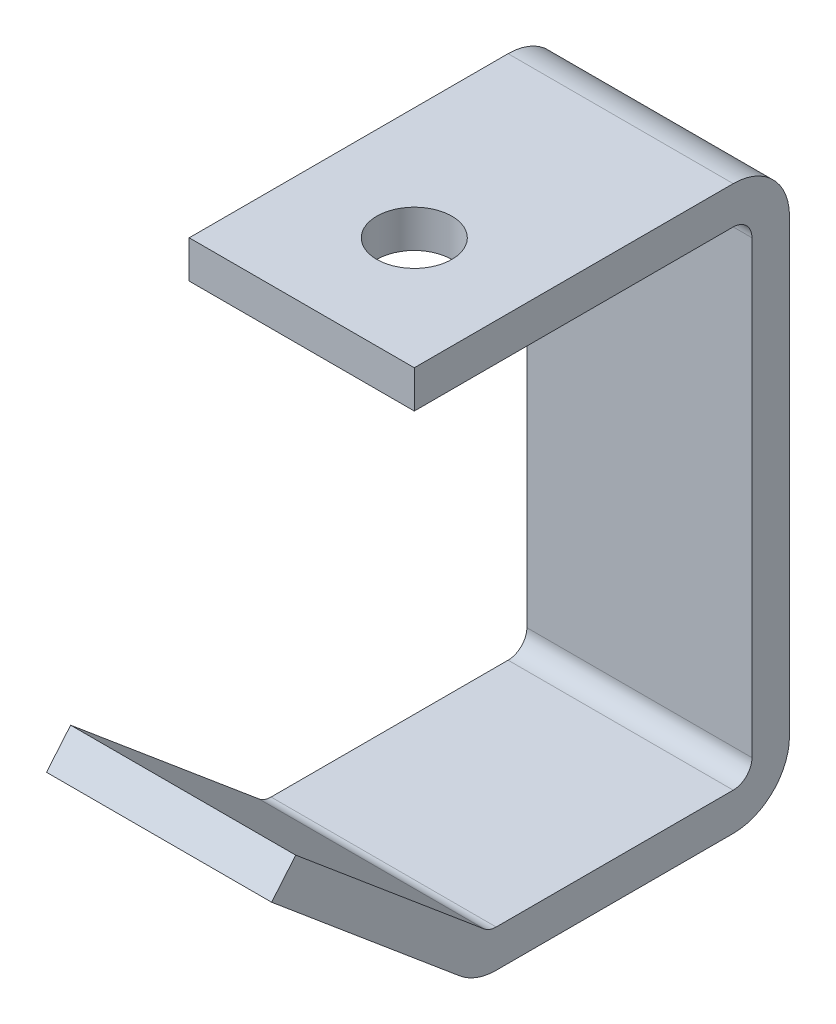
ISO-10303-21;
HEADER;
FILE_DESCRIPTION(('STEP AP214'),'2;1');
FILE_NAME('part.step','',(''),(''),'','','');
FILE_SCHEMA(('AUTOMOTIVE_DESIGN { 1 0 10303 214 1 1 1 1 }'));
ENDSEC;
DATA;
#1=APPLICATION_CONTEXT('core data for automotive mechanical design processes');
#2=APPLICATION_PROTOCOL_DEFINITION('international standard','automotive_design',2000,#1);
#3=PRODUCT_CONTEXT('',#1,'mechanical');
#4=PRODUCT('Part','Part','',(#3));
#5=PRODUCT_RELATED_PRODUCT_CATEGORY('part','',(#4));
#6=PRODUCT_DEFINITION_FORMATION('','',#4);
#7=PRODUCT_DEFINITION_CONTEXT('part definition',#1,'design');
#8=PRODUCT_DEFINITION('design','',#6,#7);
#9=PRODUCT_DEFINITION_SHAPE('','',#8);
#10=(LENGTH_UNIT() NAMED_UNIT(*) SI_UNIT(.MILLI.,.METRE.));
#11=(NAMED_UNIT(*) PLANE_ANGLE_UNIT() SI_UNIT($,.RADIAN.));
#12=(NAMED_UNIT(*) SI_UNIT($,.STERADIAN.) SOLID_ANGLE_UNIT());
#13=UNCERTAINTY_MEASURE_WITH_UNIT(LENGTH_MEASURE(1.E-05),#10,'distance_accuracy_value','');
#14=(GEOMETRIC_REPRESENTATION_CONTEXT(3) GLOBAL_UNCERTAINTY_ASSIGNED_CONTEXT((#13)) GLOBAL_UNIT_ASSIGNED_CONTEXT((#10,
#11,#12)) REPRESENTATION_CONTEXT('',''));
#15=CARTESIAN_POINT('',(0.,0.,0.));
#16=DIRECTION('',(0.,0.,1.));
#17=DIRECTION('',(1.,0.,0.));
#18=AXIS2_PLACEMENT_3D('',#15,#16,#17);
#19=CARTESIAN_POINT('',(19.05,0.742808893097248,45.3352451669596));
#20=DIRECTION('',(0.,-0.766044443118977,0.64278760968654));
#21=DIRECTION('',(0.,-0.64278760968654,-0.766044443118977));
#22=AXIS2_PLACEMENT_3D('',#19,#20,#21);
#23=PLANE('',#22);
#24=DIRECTION('',(0.,0.64278760968654,0.766044443118977));
#25=VECTOR('',#24,1.);
#26=CARTESIAN_POINT('',(-19.05,0.742808893097248,45.3352451669596));
#27=LINE('',#26,#25);
#28=CARTESIAN_POINT('',(-19.05,0.74280889309725,45.3352451669596));
#29=VERTEX_POINT('',#28);
#30=CARTESIAN_POINT('',(-19.05,27.4943401016882,77.2164785921939));
#31=VERTEX_POINT('',#30);
#32=EDGE_CURVE('E175',#29,#31,#27,.T.);
#33=ORIENTED_EDGE('',*,*,#32,.T.);
#34=DIRECTION('',(-1.,0.,0.));
#35=VECTOR('',#34,1.);
#36=CARTESIAN_POINT('',(19.05,27.4943401016882,77.2164785921939));
#37=LINE('',#36,#35);
#38=CARTESIAN_POINT('',(19.05,27.4943401016882,77.2164785921939));
#39=VERTEX_POINT('',#38);
#40=EDGE_CURVE('E11',#39,#31,#37,.T.);
#41=ORIENTED_EDGE('',*,*,#40,.F.);
#42=DIRECTION('',(0.,0.64278760968654,0.766044443118977));
#43=VECTOR('',#42,1.);
#44=CARTESIAN_POINT('',(19.05,0.742808893097248,45.3352451669596));
#45=LINE('',#44,#43);
#46=CARTESIAN_POINT('',(19.05,0.74280889309725,45.3352451669596));
#47=VERTEX_POINT('',#46);
#48=EDGE_CURVE('E112',#47,#39,#45,.T.);
#49=ORIENTED_EDGE('',*,*,#48,.F.);
#50=DIRECTION('',(-1.,0.,0.));
#51=VECTOR('',#50,1.);
#52=CARTESIAN_POINT('',(19.05,0.74280889309725,45.3352451669596));
#53=LINE('',#52,#51);
#54=EDGE_CURVE('E171',#47,#29,#53,.T.);
#55=ORIENTED_EDGE('',*,*,#54,.T.);
#56=EDGE_LOOP('',(#33,#41,#49,#55));
#57=FACE_BOUND('',#56,.T.);
#58=ADVANCED_FACE('F32',(#57),#23,.F.);
#59=CARTESIAN_POINT('',(19.05,22.6299578878827,81.2981799137034));
#60=DIRECTION('',(0.,0.642787609686542,0.766044443118976));
#61=DIRECTION('',(0.,-0.766044443118976,0.642787609686542));
#62=AXIS2_PLACEMENT_3D('',#59,#60,#61);
#63=PLANE('',#62);
#64=DIRECTION('',(0.,0.766044443118976,-0.642787609686542));
#65=VECTOR('',#64,1.);
#66=CARTESIAN_POINT('',(-19.05,22.6299578878827,81.2981799137034));
#67=LINE('',#66,#65);
#68=CARTESIAN_POINT('',(-19.05,22.6299578878827,81.2981799137034));
#69=VERTEX_POINT('',#68);
#70=EDGE_CURVE('E178',#69,#31,#67,.T.);
#71=ORIENTED_EDGE('',*,*,#70,.F.);
#72=DIRECTION('',(-1.,0.,0.));
#73=VECTOR('',#72,1.);
#74=CARTESIAN_POINT('',(19.05,22.6299578878827,81.2981799137034));
#75=LINE('',#74,#73);
#76=CARTESIAN_POINT('',(19.05,22.6299578878827,81.2981799137034));
#77=VERTEX_POINT('',#76);
#78=EDGE_CURVE('E40',#77,#69,#75,.T.);
#79=ORIENTED_EDGE('',*,*,#78,.F.);
#80=DIRECTION('',(0.,0.766044443118976,-0.642787609686542));
#81=VECTOR('',#80,1.);
#82=CARTESIAN_POINT('',(19.05,22.6299578878827,81.2981799137034));
#83=LINE('',#82,#81);
#84=EDGE_CURVE('E261',#77,#39,#83,.T.);
#85=ORIENTED_EDGE('',*,*,#84,.T.);
#86=ORIENTED_EDGE('',*,*,#40,.T.);
#87=EDGE_LOOP('',(#71,#79,#85,#86));
#88=FACE_BOUND('',#87,.T.);
#89=ADVANCED_FACE('F248',(#88),#63,.T.);
#90=CARTESIAN_POINT('',(19.05,-4.12157332070826,49.4169464884691));
#91=DIRECTION('',(0.,-0.766044443118977,0.64278760968654));
#92=DIRECTION('',(0.,-0.64278760968654,-0.766044443118977));
#93=AXIS2_PLACEMENT_3D('',#90,#91,#92);
#94=PLANE('',#93);
#95=DIRECTION('',(0.,0.64278760968654,0.766044443118977));
#96=VECTOR('',#95,1.);
#97=CARTESIAN_POINT('',(-19.05,-4.12157332070826,49.4169464884691));
#98=LINE('',#97,#96);
#99=CARTESIAN_POINT('',(-19.05,-4.12157332070826,49.4169464884691));
#100=VERTEX_POINT('',#99);
#101=EDGE_CURVE('E182',#100,#69,#98,.T.);
#102=ORIENTED_EDGE('',*,*,#101,.F.);
#103=DIRECTION('',(-1.,0.,0.));
#104=VECTOR('',#103,1.);
#105=CARTESIAN_POINT('',(19.05,-4.12157332070826,49.4169464884691));
#106=LINE('',#105,#104);
#107=CARTESIAN_POINT('',(19.05,-4.12157332070826,49.4169464884691));
#108=VERTEX_POINT('',#107);
#109=EDGE_CURVE('E238',#108,#100,#106,.T.);
#110=ORIENTED_EDGE('',*,*,#109,.F.);
#111=DIRECTION('',(0.,0.64278760968654,0.766044443118977));
#112=VECTOR('',#111,1.);
#113=CARTESIAN_POINT('',(19.05,-4.12157332070826,49.4169464884691));
#114=LINE('',#113,#112);
#115=EDGE_CURVE('E245',#108,#77,#114,.T.);
#116=ORIENTED_EDGE('',*,*,#115,.T.);
#117=ORIENTED_EDGE('',*,*,#78,.T.);
#118=EDGE_LOOP('',(#102,#110,#116,#117));
#119=FACE_BOUND('',#118,.T.);
#120=ADVANCED_FACE('F243',(#119),#94,.T.);
#121=CARTESIAN_POINT('',(19.05,3.17499999999999,43.2943945062048));
#122=DIRECTION('',(-1.,0.,0.));
#123=DIRECTION('',(0.,0.,1.));
#124=AXIS2_PLACEMENT_3D('',#121,#122,#123);
#125=CYLINDRICAL_SURFACE('',#124,9.525);
#126=CARTESIAN_POINT('',(-19.05,3.17499999999999,43.2943945062048));
#127=DIRECTION('',(1.,0.,0.));
#128=DIRECTION('',(0.,0.,-1.));
#129=AXIS2_PLACEMENT_3D('',#126,#127,#128);
#130=CIRCLE('',#129,9.525);
#131=CARTESIAN_POINT('',(-19.05,-6.35,43.2943945062048));
#132=VERTEX_POINT('',#131);
#133=EDGE_CURVE('E185',#132,#100,#130,.F.);
#134=ORIENTED_EDGE('',*,*,#133,.F.);
#135=DIRECTION('',(-1.,0.,0.));
#136=VECTOR('',#135,1.);
#137=CARTESIAN_POINT('',(19.05,-6.35,43.2943945062048));
#138=LINE('',#137,#136);
#139=CARTESIAN_POINT('',(19.05,-6.35,43.2943945062048));
#140=VERTEX_POINT('',#139);
#141=EDGE_CURVE('E236',#140,#132,#138,.T.);
#142=ORIENTED_EDGE('',*,*,#141,.F.);
#143=CARTESIAN_POINT('',(19.05,3.17499999999999,43.2943945062048));
#144=DIRECTION('',(1.,0.,0.));
#145=DIRECTION('',(0.,0.,-1.));
#146=AXIS2_PLACEMENT_3D('',#143,#144,#145);
#147=CIRCLE('',#146,9.525);
#148=EDGE_CURVE('E258',#140,#108,#147,.F.);
#149=ORIENTED_EDGE('',*,*,#148,.T.);
#150=ORIENTED_EDGE('',*,*,#109,.T.);
#151=EDGE_LOOP('',(#134,#142,#149,#150));
#152=FACE_BOUND('',#151,.T.);
#153=ADVANCED_FACE('F255',(#152),#125,.T.);
#154=CARTESIAN_POINT('',(19.05,-6.35,3.175));
#155=DIRECTION('',(0.,-1.,0.));
#156=DIRECTION('',(0.,0.,-1.));
#157=AXIS2_PLACEMENT_3D('',#154,#155,#156);
#158=PLANE('',#157);
#159=DIRECTION('',(0.,0.,-1.));
#160=VECTOR('',#159,1.);
#161=CARTESIAN_POINT('',(-19.05,-6.35,3.175));
#162=LINE('',#161,#160);
#163=CARTESIAN_POINT('',(-19.05,-6.35,3.175));
#164=VERTEX_POINT('',#163);
#165=EDGE_CURVE('E188',#164,#132,#162,.F.);
#166=ORIENTED_EDGE('',*,*,#165,.F.);
#167=DIRECTION('',(-1.,0.,0.));
#168=VECTOR('',#167,1.);
#169=CARTESIAN_POINT('',(19.05,-6.35,3.175));
#170=LINE('',#169,#168);
#171=CARTESIAN_POINT('',(19.05,-6.35,3.175));
#172=VERTEX_POINT('',#171);
#173=EDGE_CURVE('E234',#172,#164,#170,.T.);
#174=ORIENTED_EDGE('',*,*,#173,.F.);
#175=DIRECTION('',(0.,0.,-1.));
#176=VECTOR('',#175,1.);
#177=CARTESIAN_POINT('',(19.05,-6.35,3.175));
#178=LINE('',#177,#176);
#179=EDGE_CURVE('E263',#172,#140,#178,.F.);
#180=ORIENTED_EDGE('',*,*,#179,.T.);
#181=ORIENTED_EDGE('',*,*,#141,.T.);
#182=EDGE_LOOP('',(#166,#174,#180,#181));
#183=FACE_BOUND('',#182,.T.);
#184=ADVANCED_FACE('F320',(#183),#158,.T.);
#185=CARTESIAN_POINT('',(19.05,3.175,3.175));
#186=DIRECTION('',(-1.,0.,0.));
#187=DIRECTION('',(0.,0.,1.));
#188=AXIS2_PLACEMENT_3D('',#185,#186,#187);
#189=CYLINDRICAL_SURFACE('',#188,9.525);
#190=CARTESIAN_POINT('',(-19.05,3.175,3.175));
#191=DIRECTION('',(1.,0.,0.));
#192=DIRECTION('',(0.,0.,-1.));
#193=AXIS2_PLACEMENT_3D('',#190,#191,#192);
#194=CIRCLE('',#193,9.525);
#195=CARTESIAN_POINT('',(-19.05,3.175,-6.35));
#196=VERTEX_POINT('',#195);
#197=EDGE_CURVE('E191',#196,#164,#194,.F.);
#198=ORIENTED_EDGE('',*,*,#197,.F.);
#199=DIRECTION('',(-1.,0.,0.));
#200=VECTOR('',#199,1.);
#201=CARTESIAN_POINT('',(19.05,3.175,-6.35));
#202=LINE('',#201,#200);
#203=CARTESIAN_POINT('',(19.05,3.175,-6.35));
#204=VERTEX_POINT('',#203);
#205=EDGE_CURVE('E232',#204,#196,#202,.T.);
#206=ORIENTED_EDGE('',*,*,#205,.F.);
#207=CARTESIAN_POINT('',(19.05,3.175,3.175));
#208=DIRECTION('',(1.,0.,0.));
#209=DIRECTION('',(0.,0.,-1.));
#210=AXIS2_PLACEMENT_3D('',#207,#208,#209);
#211=CIRCLE('',#210,9.525);
#212=EDGE_CURVE('E269',#204,#172,#211,.F.);
#213=ORIENTED_EDGE('',*,*,#212,.T.);
#214=ORIENTED_EDGE('',*,*,#173,.T.);
#215=EDGE_LOOP('',(#198,#206,#213,#214));
#216=FACE_BOUND('',#215,.T.);
#217=ADVANCED_FACE('F323',(#216),#189,.T.);
#218=CARTESIAN_POINT('',(19.05,3.175,-6.35));
#219=DIRECTION('',(0.,0.,-1.));
#220=DIRECTION('',(-1.,0.,0.));
#221=AXIS2_PLACEMENT_3D('',#218,#219,#220);
#222=PLANE('',#221);
#223=DIRECTION('',(0.,1.,0.));
#224=VECTOR('',#223,1.);
#225=CARTESIAN_POINT('',(-19.05,3.175,-6.35));
#226=LINE('',#225,#224);
#227=CARTESIAN_POINT('',(-19.05,79.375,-6.35));
#228=VERTEX_POINT('',#227);
#229=EDGE_CURVE('E194',#228,#196,#226,.F.);
#230=ORIENTED_EDGE('',*,*,#229,.F.);
#231=DIRECTION('',(-1.,0.,0.));
#232=VECTOR('',#231,1.);
#233=CARTESIAN_POINT('',(19.05,79.375,-6.35));
#234=LINE('',#233,#232);
#235=CARTESIAN_POINT('',(19.05,79.375,-6.35));
#236=VERTEX_POINT('',#235);
#237=EDGE_CURVE('E230',#236,#228,#234,.T.);
#238=ORIENTED_EDGE('',*,*,#237,.F.);
#239=DIRECTION('',(0.,1.,0.));
#240=VECTOR('',#239,1.);
#241=CARTESIAN_POINT('',(19.05,3.175,-6.35));
#242=LINE('',#241,#240);
#243=EDGE_CURVE('E272',#236,#204,#242,.F.);
#244=ORIENTED_EDGE('',*,*,#243,.T.);
#245=ORIENTED_EDGE('',*,*,#205,.T.);
#246=EDGE_LOOP('',(#230,#238,#244,#245));
#247=FACE_BOUND('',#246,.T.);
#248=ADVANCED_FACE('F327',(#247),#222,.T.);
#249=CARTESIAN_POINT('',(19.05,79.375,3.175));
#250=DIRECTION('',(-1.,0.,0.));
#251=DIRECTION('',(0.,0.,1.));
#252=AXIS2_PLACEMENT_3D('',#249,#250,#251);
#253=CYLINDRICAL_SURFACE('',#252,9.525);
#254=CARTESIAN_POINT('',(-19.05,79.375,3.175));
#255=DIRECTION('',(1.,0.,0.));
#256=DIRECTION('',(0.,0.,-1.));
#257=AXIS2_PLACEMENT_3D('',#254,#255,#256);
#258=CIRCLE('',#257,9.525);
#259=CARTESIAN_POINT('',(-19.05,88.9,3.175));
#260=VERTEX_POINT('',#259);
#261=EDGE_CURVE('E197',#260,#228,#258,.F.);
#262=ORIENTED_EDGE('',*,*,#261,.F.);
#263=DIRECTION('',(-1.,0.,0.));
#264=VECTOR('',#263,1.);
#265=CARTESIAN_POINT('',(19.05,88.9,3.175));
#266=LINE('',#265,#264);
#267=CARTESIAN_POINT('',(19.05,88.9,3.175));
#268=VERTEX_POINT('',#267);
#269=EDGE_CURVE('E228',#268,#260,#266,.T.);
#270=ORIENTED_EDGE('',*,*,#269,.F.);
#271=CARTESIAN_POINT('',(19.05,79.375,3.175));
#272=DIRECTION('',(1.,0.,0.));
#273=DIRECTION('',(0.,0.,-1.));
#274=AXIS2_PLACEMENT_3D('',#271,#272,#273);
#275=CIRCLE('',#274,9.525);
#276=EDGE_CURVE('E275',#268,#236,#275,.F.);
#277=ORIENTED_EDGE('',*,*,#276,.T.);
#278=ORIENTED_EDGE('',*,*,#237,.T.);
#279=EDGE_LOOP('',(#262,#270,#277,#278));
#280=FACE_BOUND('',#279,.T.);
#281=ADVANCED_FACE('F331',(#280),#253,.T.);
#282=CARTESIAN_POINT('',(19.05,88.9,3.175));
#283=DIRECTION('',(0.,1.,0.));
#284=DIRECTION('',(0.,0.,1.));
#285=AXIS2_PLACEMENT_3D('',#282,#283,#284);
#286=PLANE('',#285);
#287=CARTESIAN_POINT('',(0.,88.9,38.1));
#288=DIRECTION('',(0.,1.,0.));
#289=DIRECTION('',(0.,0.,1.));
#290=AXIS2_PLACEMENT_3D('',#287,#288,#289);
#291=CIRCLE('',#290,6.35);
#292=CARTESIAN_POINT('',(0.,88.9,44.45));
#293=VERTEX_POINT('',#292);
#294=EDGE_CURVE('E410',#293,#293,#291,.T.);
#295=ORIENTED_EDGE('',*,*,#294,.F.);
#296=EDGE_LOOP('',(#295));
#297=FACE_BOUND('',#296,.T.);
#298=DIRECTION('',(0.,0.,-1.));
#299=VECTOR('',#298,1.);
#300=CARTESIAN_POINT('',(-19.05,88.9,3.175));
#301=LINE('',#300,#299);
#302=CARTESIAN_POINT('',(-19.05,88.9,57.15));
#303=VERTEX_POINT('',#302);
#304=EDGE_CURVE('E200',#303,#260,#301,.T.);
#305=ORIENTED_EDGE('',*,*,#304,.F.);
#306=DIRECTION('',(-1.,0.,0.));
#307=VECTOR('',#306,1.);
#308=CARTESIAN_POINT('',(19.05,88.9,57.15));
#309=LINE('',#308,#307);
#310=CARTESIAN_POINT('',(19.05,88.9,57.15));
#311=VERTEX_POINT('',#310);
#312=EDGE_CURVE('E226',#311,#303,#309,.T.);
#313=ORIENTED_EDGE('',*,*,#312,.F.);
#314=DIRECTION('',(0.,0.,-1.));
#315=VECTOR('',#314,1.);
#316=CARTESIAN_POINT('',(19.05,88.9,3.175));
#317=LINE('',#316,#315);
#318=EDGE_CURVE('E278',#311,#268,#317,.T.);
#319=ORIENTED_EDGE('',*,*,#318,.T.);
#320=ORIENTED_EDGE('',*,*,#269,.T.);
#321=EDGE_LOOP('',(#305,#313,#319,#320));
#322=FACE_BOUND('',#321,.T.);
#323=ADVANCED_FACE('F335',(#297,#322),#286,.T.);
#324=CARTESIAN_POINT('',(19.05,82.55,57.15));
#325=DIRECTION('',(0.,0.,1.));
#326=DIRECTION('',(0.,-1.,0.));
#327=AXIS2_PLACEMENT_3D('',#324,#325,#326);
#328=PLANE('',#327);
#329=DIRECTION('',(0.,1.,0.));
#330=VECTOR('',#329,1.);
#331=CARTESIAN_POINT('',(-19.05,82.55,57.15));
#332=LINE('',#331,#330);
#333=CARTESIAN_POINT('',(-19.05,82.55,57.15));
#334=VERTEX_POINT('',#333);
#335=EDGE_CURVE('E203',#334,#303,#332,.T.);
#336=ORIENTED_EDGE('',*,*,#335,.F.);
#337=DIRECTION('',(-1.,0.,0.));
#338=VECTOR('',#337,1.);
#339=CARTESIAN_POINT('',(19.05,82.55,57.15));
#340=LINE('',#339,#338);
#341=CARTESIAN_POINT('',(19.05,82.55,57.15));
#342=VERTEX_POINT('',#341);
#343=EDGE_CURVE('E224',#342,#334,#340,.T.);
#344=ORIENTED_EDGE('',*,*,#343,.F.);
#345=DIRECTION('',(0.,1.,0.));
#346=VECTOR('',#345,1.);
#347=CARTESIAN_POINT('',(19.05,82.55,57.15));
#348=LINE('',#347,#346);
#349=EDGE_CURVE('E281',#342,#311,#348,.T.);
#350=ORIENTED_EDGE('',*,*,#349,.T.);
#351=ORIENTED_EDGE('',*,*,#312,.T.);
#352=EDGE_LOOP('',(#336,#344,#350,#351));
#353=FACE_BOUND('',#352,.T.);
#354=ADVANCED_FACE('F339',(#353),#328,.T.);
#355=CARTESIAN_POINT('',(19.05,82.55,3.175));
#356=DIRECTION('',(0.,1.,0.));
#357=DIRECTION('',(0.,0.,1.));
#358=AXIS2_PLACEMENT_3D('',#355,#356,#357);
#359=PLANE('',#358);
#360=CARTESIAN_POINT('',(0.,82.55,38.1));
#361=DIRECTION('',(0.,1.,0.));
#362=DIRECTION('',(0.,0.,1.));
#363=AXIS2_PLACEMENT_3D('',#360,#361,#362);
#364=CIRCLE('',#363,6.35);
#365=CARTESIAN_POINT('',(0.,82.55,44.45));
#366=VERTEX_POINT('',#365);
#367=EDGE_CURVE('E179',#366,#366,#364,.F.);
#368=ORIENTED_EDGE('',*,*,#367,.F.);
#369=EDGE_LOOP('',(#368));
#370=FACE_BOUND('',#369,.T.);
#371=DIRECTION('',(0.,0.,-1.));
#372=VECTOR('',#371,1.);
#373=CARTESIAN_POINT('',(-19.05,82.55,3.175));
#374=LINE('',#373,#372);
#375=CARTESIAN_POINT('',(-19.05,82.55,3.175));
#376=VERTEX_POINT('',#375);
#377=EDGE_CURVE('E206',#334,#376,#374,.T.);
#378=ORIENTED_EDGE('',*,*,#377,.T.);
#379=DIRECTION('',(-1.,0.,0.));
#380=VECTOR('',#379,1.);
#381=CARTESIAN_POINT('',(19.05,82.55,3.175));
#382=LINE('',#381,#380);
#383=CARTESIAN_POINT('',(19.05,82.55,3.175));
#384=VERTEX_POINT('',#383);
#385=EDGE_CURVE('E221',#384,#376,#382,.T.);
#386=ORIENTED_EDGE('',*,*,#385,.F.);
#387=DIRECTION('',(0.,0.,-1.));
#388=VECTOR('',#387,1.);
#389=CARTESIAN_POINT('',(19.05,82.55,3.175));
#390=LINE('',#389,#388);
#391=EDGE_CURVE('E284',#342,#384,#390,.T.);
#392=ORIENTED_EDGE('',*,*,#391,.F.);
#393=ORIENTED_EDGE('',*,*,#343,.T.);
#394=EDGE_LOOP('',(#378,#386,#392,#393));
#395=FACE_BOUND('',#394,.T.);
#396=ADVANCED_FACE('F343',(#370,#395),#359,.F.);
#397=CARTESIAN_POINT('',(19.05,79.375,3.175));
#398=DIRECTION('',(-1.,0.,0.));
#399=DIRECTION('',(0.,0.,1.));
#400=AXIS2_PLACEMENT_3D('',#397,#398,#399);
#401=CYLINDRICAL_SURFACE('',#400,3.175);
#402=CARTESIAN_POINT('',(-19.05,79.375,3.175));
#403=DIRECTION('',(-1.,0.,0.));
#404=DIRECTION('',(0.,0.,-1.));
#405=AXIS2_PLACEMENT_3D('',#402,#403,#404);
#406=CIRCLE('',#405,3.175);
#407=CARTESIAN_POINT('',(-19.05,79.375,0.));
#408=VERTEX_POINT('',#407);
#409=EDGE_CURVE('E208',#376,#408,#406,.T.);
#410=ORIENTED_EDGE('',*,*,#409,.T.);
#411=DIRECTION('',(-1.,0.,0.));
#412=VECTOR('',#411,1.);
#413=CARTESIAN_POINT('',(19.05,79.375,0.));
#414=LINE('',#413,#412);
#415=CARTESIAN_POINT('',(19.05,79.375,0.));
#416=VERTEX_POINT('',#415);
#417=EDGE_CURVE('E218',#416,#408,#414,.T.);
#418=ORIENTED_EDGE('',*,*,#417,.F.);
#419=CARTESIAN_POINT('',(19.05,79.375,3.175));
#420=DIRECTION('',(-1.,0.,0.));
#421=DIRECTION('',(0.,0.,-1.));
#422=AXIS2_PLACEMENT_3D('',#419,#420,#421);
#423=CIRCLE('',#422,3.175);
#424=EDGE_CURVE('E286',#384,#416,#423,.T.);
#425=ORIENTED_EDGE('',*,*,#424,.F.);
#426=ORIENTED_EDGE('',*,*,#385,.T.);
#427=EDGE_LOOP('',(#410,#418,#425,#426));
#428=FACE_BOUND('',#427,.T.);
#429=ADVANCED_FACE('F293',(#428),#401,.F.);
#430=CARTESIAN_POINT('',(19.05,3.175,0.));
#431=DIRECTION('',(0.,0.,-1.));
#432=DIRECTION('',(-1.,0.,0.));
#433=AXIS2_PLACEMENT_3D('',#430,#431,#432);
#434=PLANE('',#433);
#435=DIRECTION('',(0.,-1.,0.));
#436=VECTOR('',#435,1.);
#437=CARTESIAN_POINT('',(-19.05,3.175,0.));
#438=LINE('',#437,#436);
#439=CARTESIAN_POINT('',(-19.05,3.175,0.));
#440=VERTEX_POINT('',#439);
#441=EDGE_CURVE('E210',#408,#440,#438,.T.);
#442=ORIENTED_EDGE('',*,*,#441,.T.);
#443=DIRECTION('',(-1.,0.,0.));
#444=VECTOR('',#443,1.);
#445=CARTESIAN_POINT('',(19.05,3.175,0.));
#446=LINE('',#445,#444);
#447=CARTESIAN_POINT('',(19.05,3.175,0.));
#448=VERTEX_POINT('',#447);
#449=EDGE_CURVE('E166',#448,#440,#446,.T.);
#450=ORIENTED_EDGE('',*,*,#449,.F.);
#451=DIRECTION('',(0.,-1.,0.));
#452=VECTOR('',#451,1.);
#453=CARTESIAN_POINT('',(19.05,3.175,0.));
#454=LINE('',#453,#452);
#455=EDGE_CURVE('E157',#416,#448,#454,.T.);
#456=ORIENTED_EDGE('',*,*,#455,.F.);
#457=ORIENTED_EDGE('',*,*,#417,.T.);
#458=EDGE_LOOP('',(#442,#450,#456,#457));
#459=FACE_BOUND('',#458,.T.);
#460=ADVANCED_FACE('F297',(#459),#434,.F.);
#461=CARTESIAN_POINT('',(19.05,3.175,3.175));
#462=DIRECTION('',(-1.,0.,0.));
#463=DIRECTION('',(0.,0.,1.));
#464=AXIS2_PLACEMENT_3D('',#461,#462,#463);
#465=CYLINDRICAL_SURFACE('',#464,3.175);
#466=CARTESIAN_POINT('',(-19.05,3.175,3.175));
#467=DIRECTION('',(-1.,0.,0.));
#468=DIRECTION('',(0.,0.,1.));
#469=AXIS2_PLACEMENT_3D('',#466,#467,#468);
#470=CIRCLE('',#469,3.175);
#471=CARTESIAN_POINT('',(-19.05,0.,3.175));
#472=VERTEX_POINT('',#471);
#473=EDGE_CURVE('E165',#440,#472,#470,.T.);
#474=ORIENTED_EDGE('',*,*,#473,.T.);
#475=DIRECTION('',(-1.,0.,0.));
#476=VECTOR('',#475,1.);
#477=CARTESIAN_POINT('',(19.05,0.,3.175));
#478=LINE('',#477,#476);
#479=CARTESIAN_POINT('',(19.05,0.,3.175));
#480=VERTEX_POINT('',#479);
#481=EDGE_CURVE('E162',#480,#472,#478,.T.);
#482=ORIENTED_EDGE('',*,*,#481,.F.);
#483=CARTESIAN_POINT('',(19.05,3.175,3.175));
#484=DIRECTION('',(-1.,0.,0.));
#485=DIRECTION('',(0.,0.,1.));
#486=AXIS2_PLACEMENT_3D('',#483,#484,#485);
#487=CIRCLE('',#486,3.175);
#488=EDGE_CURVE('E151',#448,#480,#487,.T.);
#489=ORIENTED_EDGE('',*,*,#488,.F.);
#490=ORIENTED_EDGE('',*,*,#449,.T.);
#491=EDGE_LOOP('',(#474,#482,#489,#490));
#492=FACE_BOUND('',#491,.T.);
#493=ADVANCED_FACE('F163',(#492),#465,.F.);
#494=CARTESIAN_POINT('',(19.05,0.,3.175));
#495=DIRECTION('',(0.,-1.,0.));
#496=DIRECTION('',(0.,0.,-1.));
#497=AXIS2_PLACEMENT_3D('',#494,#495,#496);
#498=PLANE('',#497);
#499=DIRECTION('',(0.,0.,1.));
#500=VECTOR('',#499,1.);
#501=CARTESIAN_POINT('',(-19.05,0.,3.175));
#502=LINE('',#501,#500);
#503=CARTESIAN_POINT('',(-19.05,0.,43.2943945062048));
#504=VERTEX_POINT('',#503);
#505=EDGE_CURVE('E100',#472,#504,#502,.T.);
#506=ORIENTED_EDGE('',*,*,#505,.T.);
#507=DIRECTION('',(-1.,0.,0.));
#508=VECTOR('',#507,1.);
#509=CARTESIAN_POINT('',(19.05,0.,43.2943945062048));
#510=LINE('',#509,#508);
#511=CARTESIAN_POINT('',(19.05,0.,43.2943945062048));
#512=VERTEX_POINT('',#511);
#513=EDGE_CURVE('E167',#512,#504,#510,.T.);
#514=ORIENTED_EDGE('',*,*,#513,.F.);
#515=DIRECTION('',(0.,0.,1.));
#516=VECTOR('',#515,1.);
#517=CARTESIAN_POINT('',(19.05,0.,3.175));
#518=LINE('',#517,#516);
#519=EDGE_CURVE('E155',#480,#512,#518,.T.);
#520=ORIENTED_EDGE('',*,*,#519,.F.);
#521=ORIENTED_EDGE('',*,*,#481,.T.);
#522=EDGE_LOOP('',(#506,#514,#520,#521));
#523=FACE_BOUND('',#522,.T.);
#524=ADVANCED_FACE('F169',(#523),#498,.F.);
#525=CARTESIAN_POINT('',(19.05,3.17499999999999,43.2943945062048));
#526=DIRECTION('',(-1.,0.,0.));
#527=DIRECTION('',(0.,0.,1.));
#528=AXIS2_PLACEMENT_3D('',#525,#526,#527);
#529=CYLINDRICAL_SURFACE('',#528,3.175);
#530=CARTESIAN_POINT('',(-19.05,3.17499999999999,43.2943945062048));
#531=DIRECTION('',(-1.,0.,0.));
#532=DIRECTION('',(0.,0.,1.));
#533=AXIS2_PLACEMENT_3D('',#530,#531,#532);
#534=CIRCLE('',#533,3.175);
#535=EDGE_CURVE('E106',#504,#29,#534,.T.);
#536=ORIENTED_EDGE('',*,*,#535,.T.);
#537=ORIENTED_EDGE('',*,*,#54,.F.);
#538=CARTESIAN_POINT('',(19.05,3.17499999999999,43.2943945062048));
#539=DIRECTION('',(-1.,0.,0.));
#540=DIRECTION('',(0.,0.,1.));
#541=AXIS2_PLACEMENT_3D('',#538,#539,#540);
#542=CIRCLE('',#541,3.175);
#543=EDGE_CURVE('E48',#512,#47,#542,.T.);
#544=ORIENTED_EDGE('',*,*,#543,.F.);
#545=ORIENTED_EDGE('',*,*,#513,.T.);
#546=EDGE_LOOP('',(#536,#537,#544,#545));
#547=FACE_BOUND('',#546,.T.);
#548=ADVANCED_FACE('F299',(#547),#529,.F.);
#549=CARTESIAN_POINT('',(19.05,3.17499999999999,43.2943945062048));
#550=DIRECTION('',(1.,0.,0.));
#551=DIRECTION('',(0.,0.,-1.));
#552=AXIS2_PLACEMENT_3D('',#549,#550,#551);
#553=PLANE('',#552);
#554=ORIENTED_EDGE('',*,*,#48,.T.);
#555=ORIENTED_EDGE('',*,*,#84,.F.);
#556=ORIENTED_EDGE('',*,*,#115,.F.);
#557=ORIENTED_EDGE('',*,*,#148,.F.);
#558=ORIENTED_EDGE('',*,*,#179,.F.);
#559=ORIENTED_EDGE('',*,*,#212,.F.);
#560=ORIENTED_EDGE('',*,*,#243,.F.);
#561=ORIENTED_EDGE('',*,*,#276,.F.);
#562=ORIENTED_EDGE('',*,*,#318,.F.);
#563=ORIENTED_EDGE('',*,*,#349,.F.);
#564=ORIENTED_EDGE('',*,*,#391,.T.);
#565=ORIENTED_EDGE('',*,*,#424,.T.);
#566=ORIENTED_EDGE('',*,*,#455,.T.);
#567=ORIENTED_EDGE('',*,*,#488,.T.);
#568=ORIENTED_EDGE('',*,*,#519,.T.);
#569=ORIENTED_EDGE('',*,*,#543,.T.);
#570=EDGE_LOOP('',(#554,#555,#556,#557,#558,#559,#560,#561,#562,#563,#564,#565,#566,#567,#568,#569));
#571=FACE_BOUND('',#570,.T.);
#572=ADVANCED_FACE('F153',(#571),#553,.T.);
#573=CARTESIAN_POINT('',(-19.05,3.17499999999999,43.2943945062048));
#574=DIRECTION('',(1.,0.,0.));
#575=DIRECTION('',(0.,0.,-1.));
#576=AXIS2_PLACEMENT_3D('',#573,#574,#575);
#577=PLANE('',#576);
#578=ORIENTED_EDGE('',*,*,#32,.F.);
#579=ORIENTED_EDGE('',*,*,#535,.F.);
#580=ORIENTED_EDGE('',*,*,#505,.F.);
#581=ORIENTED_EDGE('',*,*,#473,.F.);
#582=ORIENTED_EDGE('',*,*,#441,.F.);
#583=ORIENTED_EDGE('',*,*,#409,.F.);
#584=ORIENTED_EDGE('',*,*,#377,.F.);
#585=ORIENTED_EDGE('',*,*,#335,.T.);
#586=ORIENTED_EDGE('',*,*,#304,.T.);
#587=ORIENTED_EDGE('',*,*,#261,.T.);
#588=ORIENTED_EDGE('',*,*,#229,.T.);
#589=ORIENTED_EDGE('',*,*,#197,.T.);
#590=ORIENTED_EDGE('',*,*,#165,.T.);
#591=ORIENTED_EDGE('',*,*,#133,.T.);
#592=ORIENTED_EDGE('',*,*,#101,.T.);
#593=ORIENTED_EDGE('',*,*,#70,.T.);
#594=EDGE_LOOP('',(#578,#579,#580,#581,#582,#583,#584,#585,#586,#587,#588,#589,#590,#591,#592,#593));
#595=FACE_BOUND('',#594,.T.);
#596=ADVANCED_FACE('F251',(#595),#577,.F.);
#597=CARTESIAN_POINT('',(0.,-6.35100000000002,38.1));
#598=DIRECTION('',(0.,1.,0.));
#599=DIRECTION('',(0.,0.,1.));
#600=AXIS2_PLACEMENT_3D('',#597,#598,#599);
#601=CYLINDRICAL_SURFACE('',#600,6.35);
#602=ORIENTED_EDGE('',*,*,#294,.T.);
#603=EDGE_LOOP('',(#602));
#604=FACE_BOUND('',#603,.T.);
#605=ORIENTED_EDGE('',*,*,#367,.T.);
#606=EDGE_LOOP('',(#605));
#607=FACE_BOUND('',#606,.T.);
#608=ADVANCED_FACE('F380',(#604,#607),#601,.F.);
#609=CLOSED_SHELL('',(#58,#89,#120,#153,#184,#217,#248,#281,#323,#354,#396,#429,#460,#493,#524,
#548,#572,#596,#608));
#610=MANIFOLD_SOLID_BREP('B2',#609);
#611=ADVANCED_BREP_SHAPE_REPRESENTATION('',(#18,#610),#14);
#612=SHAPE_DEFINITION_REPRESENTATION(#9,#611);
ENDSEC;
END-ISO-10303-21;
